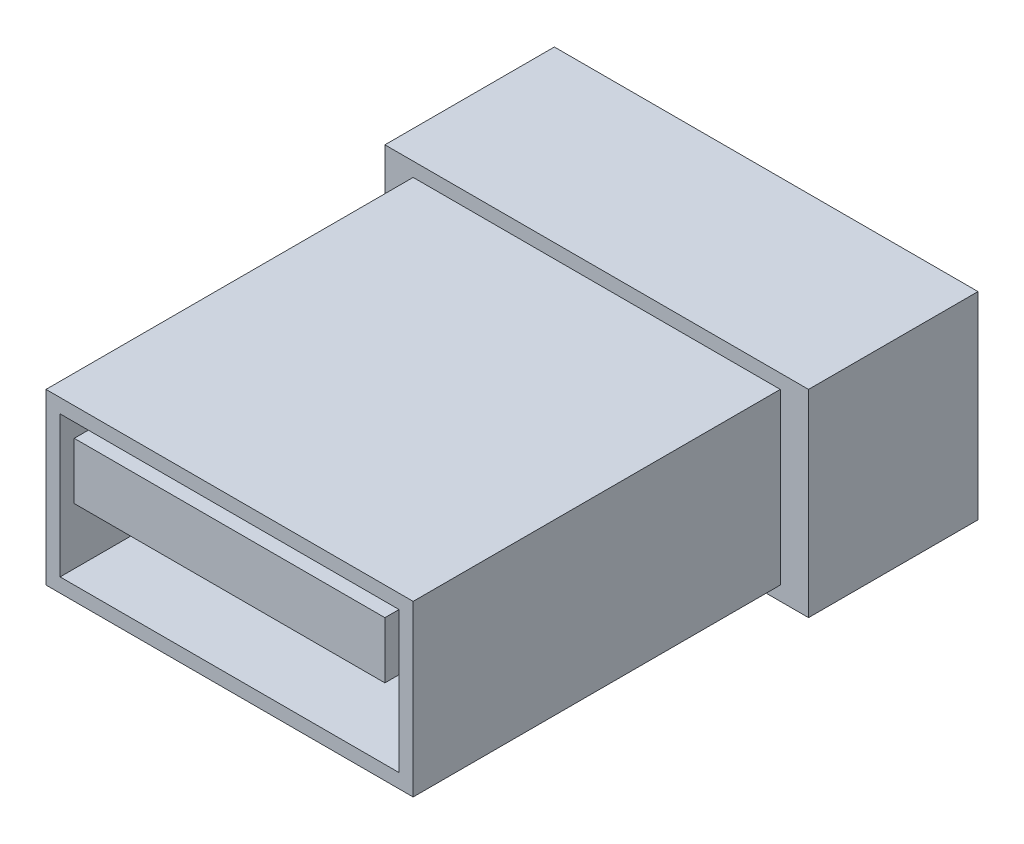
ISO-10303-21;
HEADER;
FILE_DESCRIPTION(('STEP AP214'),'2;1');
FILE_NAME('part.step','',(''),(''),'','','');
FILE_SCHEMA(('AUTOMOTIVE_DESIGN { 1 0 10303 214 1 1 1 1 }'));
ENDSEC;
DATA;
#1=APPLICATION_CONTEXT('core data for automotive mechanical design processes');
#2=APPLICATION_PROTOCOL_DEFINITION('international standard','automotive_design',2000,#1);
#3=PRODUCT_CONTEXT('',#1,'mechanical');
#4=PRODUCT('Part','Part','',(#3));
#5=PRODUCT_RELATED_PRODUCT_CATEGORY('part','',(#4));
#6=PRODUCT_DEFINITION_FORMATION('','',#4);
#7=PRODUCT_DEFINITION_CONTEXT('part definition',#1,'design');
#8=PRODUCT_DEFINITION('design','',#6,#7);
#9=PRODUCT_DEFINITION_SHAPE('','',#8);
#10=(LENGTH_UNIT() NAMED_UNIT(*) SI_UNIT(.MILLI.,.METRE.));
#11=(NAMED_UNIT(*) PLANE_ANGLE_UNIT() SI_UNIT($,.RADIAN.));
#12=(NAMED_UNIT(*) SI_UNIT($,.STERADIAN.) SOLID_ANGLE_UNIT());
#13=UNCERTAINTY_MEASURE_WITH_UNIT(LENGTH_MEASURE(1.E-05),#10,'distance_accuracy_value','');
#14=(GEOMETRIC_REPRESENTATION_CONTEXT(3) GLOBAL_UNCERTAINTY_ASSIGNED_CONTEXT((#13)) GLOBAL_UNIT_ASSIGNED_CONTEXT((#10,
#11,#12)) REPRESENTATION_CONTEXT('',''));
#15=CARTESIAN_POINT('',(0.,0.,0.));
#16=DIRECTION('',(0.,0.,1.));
#17=DIRECTION('',(1.,0.,0.));
#18=AXIS2_PLACEMENT_3D('',#15,#16,#17);
#19=CARTESIAN_POINT('',(6.,6.,0.));
#20=DIRECTION('',(0.,0.,-1.));
#21=DIRECTION('',(0.,1.,0.));
#22=AXIS2_PLACEMENT_3D('',#19,#20,#21);
#23=PLANE('',#22);
#24=DIRECTION('',(-1.,0.,0.));
#25=VECTOR('',#24,1.);
#26=CARTESIAN_POINT('',(6.,-1.,0.));
#27=LINE('',#26,#25);
#28=CARTESIAN_POINT('',(7.5,-1.,0.));
#29=VERTEX_POINT('',#28);
#30=CARTESIAN_POINT('',(-7.5,-1.,0.));
#31=VERTEX_POINT('',#30);
#32=EDGE_CURVE('E333',#29,#31,#27,.T.);
#33=ORIENTED_EDGE('',*,*,#32,.F.);
#34=DIRECTION('',(0.,-1.,0.));
#35=VECTOR('',#34,1.);
#36=CARTESIAN_POINT('',(7.5,6.,0.));
#37=LINE('',#36,#35);
#38=CARTESIAN_POINT('',(7.5,6.,0.));
#39=VERTEX_POINT('',#38);
#40=EDGE_CURVE('E316',#39,#29,#37,.T.);
#41=ORIENTED_EDGE('',*,*,#40,.F.);
#42=DIRECTION('',(-1.,0.,0.));
#43=VECTOR('',#42,1.);
#44=CARTESIAN_POINT('',(6.,6.,0.));
#45=LINE('',#44,#43);
#46=CARTESIAN_POINT('',(-7.5,6.,0.));
#47=VERTEX_POINT('',#46);
#48=EDGE_CURVE('E350',#39,#47,#45,.T.);
#49=ORIENTED_EDGE('',*,*,#48,.T.);
#50=DIRECTION('',(0.,-1.,0.));
#51=VECTOR('',#50,1.);
#52=CARTESIAN_POINT('',(-7.5,6.,0.));
#53=LINE('',#52,#51);
#54=EDGE_CURVE('E303',#47,#31,#53,.T.);
#55=ORIENTED_EDGE('',*,*,#54,.T.);
#56=EDGE_LOOP('',(#33,#41,#49,#55));
#57=FACE_BOUND('',#56,.T.);
#58=DIRECTION('',(0.,-1.,0.));
#59=VECTOR('',#58,1.);
#60=CARTESIAN_POINT('',(-6.5,5.,0.));
#61=LINE('',#60,#59);
#62=CARTESIAN_POINT('',(-6.5,5.5,0.));
#63=VERTEX_POINT('',#62);
#64=CARTESIAN_POINT('',(-6.5,-0.499999999999999,0.));
#65=VERTEX_POINT('',#64);
#66=EDGE_CURVE('E197',#63,#65,#61,.T.);
#67=ORIENTED_EDGE('',*,*,#66,.F.);
#68=DIRECTION('',(-1.,0.,0.));
#69=VECTOR('',#68,1.);
#70=CARTESIAN_POINT('',(-6.,5.5,0.));
#71=LINE('',#70,#69);
#72=CARTESIAN_POINT('',(6.5,5.5,0.));
#73=VERTEX_POINT('',#72);
#74=EDGE_CURVE('E236',#73,#63,#71,.T.);
#75=ORIENTED_EDGE('',*,*,#74,.F.);
#76=DIRECTION('',(0.,1.,0.));
#77=VECTOR('',#76,1.);
#78=CARTESIAN_POINT('',(6.5,5.,0.));
#79=LINE('',#78,#77);
#80=CARTESIAN_POINT('',(6.5,-0.5,0.));
#81=VERTEX_POINT('',#80);
#82=EDGE_CURVE('E86',#81,#73,#79,.T.);
#83=ORIENTED_EDGE('',*,*,#82,.F.);
#84=DIRECTION('',(1.,0.,0.));
#85=VECTOR('',#84,1.);
#86=CARTESIAN_POINT('',(-6.,-0.499999999999999,0.));
#87=LINE('',#86,#85);
#88=EDGE_CURVE('E81',#65,#81,#87,.T.);
#89=ORIENTED_EDGE('',*,*,#88,.F.);
#90=EDGE_LOOP('',(#67,#75,#83,#89));
#91=FACE_BOUND('',#90,.T.);
#92=ADVANCED_FACE('F65',(#57,#91),#23,.F.);
#93=CARTESIAN_POINT('',(6.,6.,-6.));
#94=DIRECTION('',(0.,0.,-1.));
#95=DIRECTION('',(0.,1.,0.));
#96=AXIS2_PLACEMENT_3D('',#93,#94,#95);
#97=PLANE('',#96);
#98=DIRECTION('',(-1.,0.,0.));
#99=VECTOR('',#98,1.);
#100=CARTESIAN_POINT('',(6.,-1.,-6.));
#101=LINE('',#100,#99);
#102=CARTESIAN_POINT('',(7.5,-1.,-6.));
#103=VERTEX_POINT('',#102);
#104=CARTESIAN_POINT('',(-7.5,-1.,-6.));
#105=VERTEX_POINT('',#104);
#106=EDGE_CURVE('E12',#103,#105,#101,.T.);
#107=ORIENTED_EDGE('',*,*,#106,.T.);
#108=DIRECTION('',(0.,1.,0.));
#109=VECTOR('',#108,1.);
#110=CARTESIAN_POINT('',(-7.5,6.,-6.));
#111=LINE('',#110,#109);
#112=CARTESIAN_POINT('',(-7.5,6.,-6.));
#113=VERTEX_POINT('',#112);
#114=EDGE_CURVE('E341',#105,#113,#111,.T.);
#115=ORIENTED_EDGE('',*,*,#114,.T.);
#116=DIRECTION('',(-1.,0.,0.));
#117=VECTOR('',#116,1.);
#118=CARTESIAN_POINT('',(6.,6.,-6.));
#119=LINE('',#118,#117);
#120=CARTESIAN_POINT('',(7.5,6.,-6.));
#121=VERTEX_POINT('',#120);
#122=EDGE_CURVE('E74',#121,#113,#119,.T.);
#123=ORIENTED_EDGE('',*,*,#122,.F.);
#124=DIRECTION('',(0.,1.,0.));
#125=VECTOR('',#124,1.);
#126=CARTESIAN_POINT('',(7.5,6.,-6.));
#127=LINE('',#126,#125);
#128=EDGE_CURVE('E325',#103,#121,#127,.T.);
#129=ORIENTED_EDGE('',*,*,#128,.F.);
#130=EDGE_LOOP('',(#107,#115,#123,#129));
#131=FACE_BOUND('',#130,.T.);
#132=ADVANCED_FACE('F361',(#131),#97,.T.);
#133=CARTESIAN_POINT('',(6.,6.,0.));
#134=DIRECTION('',(0.,1.,0.));
#135=DIRECTION('',(0.,0.,1.));
#136=AXIS2_PLACEMENT_3D('',#133,#134,#135);
#137=PLANE('',#136);
#138=ORIENTED_EDGE('',*,*,#122,.T.);
#139=DIRECTION('',(0.,0.,1.));
#140=VECTOR('',#139,1.);
#141=CARTESIAN_POINT('',(-7.5,6.,0.));
#142=LINE('',#141,#140);
#143=EDGE_CURVE('E321',#113,#47,#142,.T.);
#144=ORIENTED_EDGE('',*,*,#143,.T.);
#145=ORIENTED_EDGE('',*,*,#48,.F.);
#146=DIRECTION('',(0.,0.,1.));
#147=VECTOR('',#146,1.);
#148=CARTESIAN_POINT('',(7.5,6.,0.));
#149=LINE('',#148,#147);
#150=EDGE_CURVE('E329',#121,#39,#149,.T.);
#151=ORIENTED_EDGE('',*,*,#150,.F.);
#152=EDGE_LOOP('',(#138,#144,#145,#151));
#153=FACE_BOUND('',#152,.T.);
#154=ADVANCED_FACE('F355',(#153),#137,.T.);
#155=CARTESIAN_POINT('',(6.,-1.,0.));
#156=DIRECTION('',(0.,1.,0.));
#157=DIRECTION('',(0.,0.,1.));
#158=AXIS2_PLACEMENT_3D('',#155,#156,#157);
#159=PLANE('',#158);
#160=ORIENTED_EDGE('',*,*,#32,.T.);
#161=DIRECTION('',(0.,0.,-1.));
#162=VECTOR('',#161,1.);
#163=CARTESIAN_POINT('',(-7.5,-1.,0.));
#164=LINE('',#163,#162);
#165=EDGE_CURVE('E337',#31,#105,#164,.T.);
#166=ORIENTED_EDGE('',*,*,#165,.T.);
#167=ORIENTED_EDGE('',*,*,#106,.F.);
#168=DIRECTION('',(0.,0.,-1.));
#169=VECTOR('',#168,1.);
#170=CARTESIAN_POINT('',(7.5,-1.,0.));
#171=LINE('',#170,#169);
#172=EDGE_CURVE('E320',#29,#103,#171,.T.);
#173=ORIENTED_EDGE('',*,*,#172,.F.);
#174=EDGE_LOOP('',(#160,#166,#167,#173));
#175=FACE_BOUND('',#174,.T.);
#176=ADVANCED_FACE('F67',(#175),#159,.F.);
#177=CARTESIAN_POINT('',(-7.5,0.,0.));
#178=DIRECTION('',(1.,0.,0.));
#179=DIRECTION('',(0.,0.,-1.));
#180=AXIS2_PLACEMENT_3D('',#177,#178,#179);
#181=PLANE('',#180);
#182=ORIENTED_EDGE('',*,*,#54,.F.);
#183=ORIENTED_EDGE('',*,*,#143,.F.);
#184=ORIENTED_EDGE('',*,*,#114,.F.);
#185=ORIENTED_EDGE('',*,*,#165,.F.);
#186=EDGE_LOOP('',(#182,#183,#184,#185));
#187=FACE_BOUND('',#186,.T.);
#188=ADVANCED_FACE('F364',(#187),#181,.F.);
#189=CARTESIAN_POINT('',(7.5,0.,0.));
#190=DIRECTION('',(1.,0.,0.));
#191=DIRECTION('',(0.,0.,-1.));
#192=AXIS2_PLACEMENT_3D('',#189,#190,#191);
#193=PLANE('',#192);
#194=ORIENTED_EDGE('',*,*,#40,.T.);
#195=ORIENTED_EDGE('',*,*,#172,.T.);
#196=ORIENTED_EDGE('',*,*,#128,.T.);
#197=ORIENTED_EDGE('',*,*,#150,.T.);
#198=EDGE_LOOP('',(#194,#195,#196,#197));
#199=FACE_BOUND('',#198,.T.);
#200=ADVANCED_FACE('F369',(#199),#193,.T.);
#201=CARTESIAN_POINT('',(0.,0.,13.));
#202=DIRECTION('',(0.,0.,1.));
#203=DIRECTION('',(1.,0.,0.));
#204=AXIS2_PLACEMENT_3D('',#201,#202,#203);
#205=PLANE('',#204);
#206=DIRECTION('',(0.,-1.,0.));
#207=VECTOR('',#206,1.);
#208=CARTESIAN_POINT('',(-6.5,5.,13.));
#209=LINE('',#208,#207);
#210=CARTESIAN_POINT('',(-6.5,5.5,13.));
#211=VERTEX_POINT('',#210);
#212=CARTESIAN_POINT('',(-6.5,-0.499999999999999,13.));
#213=VERTEX_POINT('',#212);
#214=EDGE_CURVE('E231',#211,#213,#209,.T.);
#215=ORIENTED_EDGE('',*,*,#214,.T.);
#216=DIRECTION('',(1.,0.,0.));
#217=VECTOR('',#216,1.);
#218=CARTESIAN_POINT('',(-6.,-0.499999999999999,13.));
#219=LINE('',#218,#217);
#220=CARTESIAN_POINT('',(6.5,-0.499999999999999,13.));
#221=VERTEX_POINT('',#220);
#222=EDGE_CURVE('E235',#213,#221,#219,.T.);
#223=ORIENTED_EDGE('',*,*,#222,.T.);
#224=DIRECTION('',(0.,1.,0.));
#225=VECTOR('',#224,1.);
#226=CARTESIAN_POINT('',(6.5,5.,13.));
#227=LINE('',#226,#225);
#228=CARTESIAN_POINT('',(6.5,5.5,13.));
#229=VERTEX_POINT('',#228);
#230=EDGE_CURVE('E239',#221,#229,#227,.T.);
#231=ORIENTED_EDGE('',*,*,#230,.T.);
#232=DIRECTION('',(-1.,0.,0.));
#233=VECTOR('',#232,1.);
#234=CARTESIAN_POINT('',(-6.,5.5,13.));
#235=LINE('',#234,#233);
#236=EDGE_CURVE('E242',#229,#211,#235,.T.);
#237=ORIENTED_EDGE('',*,*,#236,.T.);
#238=EDGE_LOOP('',(#215,#223,#231,#237));
#239=FACE_BOUND('',#238,.T.);
#240=DIRECTION('',(1.,0.,0.));
#241=VECTOR('',#240,1.);
#242=CARTESIAN_POINT('',(-6.,0.,13.));
#243=LINE('',#242,#241);
#244=CARTESIAN_POINT('',(-6.,0.,13.));
#245=VERTEX_POINT('',#244);
#246=CARTESIAN_POINT('',(6.,0.,13.));
#247=VERTEX_POINT('',#246);
#248=EDGE_CURVE('E188',#245,#247,#243,.T.);
#249=ORIENTED_EDGE('',*,*,#248,.F.);
#250=DIRECTION('',(0.,-1.,0.));
#251=VECTOR('',#250,1.);
#252=CARTESIAN_POINT('',(-6.,5.,13.));
#253=LINE('',#252,#251);
#254=CARTESIAN_POINT('',(-6.,5.,13.));
#255=VERTEX_POINT('',#254);
#256=EDGE_CURVE('E177',#255,#245,#253,.T.);
#257=ORIENTED_EDGE('',*,*,#256,.F.);
#258=DIRECTION('',(-1.,0.,0.));
#259=VECTOR('',#258,1.);
#260=CARTESIAN_POINT('',(-6.,5.,13.));
#261=LINE('',#260,#259);
#262=CARTESIAN_POINT('',(6.,5.,13.));
#263=VERTEX_POINT('',#262);
#264=EDGE_CURVE('E207',#263,#255,#261,.T.);
#265=ORIENTED_EDGE('',*,*,#264,.F.);
#266=DIRECTION('',(0.,1.,0.));
#267=VECTOR('',#266,1.);
#268=CARTESIAN_POINT('',(6.,5.,13.));
#269=LINE('',#268,#267);
#270=EDGE_CURVE('E203',#247,#263,#269,.T.);
#271=ORIENTED_EDGE('',*,*,#270,.F.);
#272=EDGE_LOOP('',(#249,#257,#265,#271));
#273=FACE_BOUND('',#272,.T.);
#274=ADVANCED_FACE('F201',(#239,#273),#205,.T.);
#275=CARTESIAN_POINT('',(-6.5,5.,13.));
#276=DIRECTION('',(1.,0.,0.));
#277=DIRECTION('',(0.,1.,0.));
#278=AXIS2_PLACEMENT_3D('',#275,#276,#277);
#279=PLANE('',#278);
#280=ORIENTED_EDGE('',*,*,#66,.T.);
#281=DIRECTION('',(0.,0.,-1.));
#282=VECTOR('',#281,1.);
#283=CARTESIAN_POINT('',(-6.5,-0.499999999999999,13.));
#284=LINE('',#283,#282);
#285=EDGE_CURVE('E267',#213,#65,#284,.T.);
#286=ORIENTED_EDGE('',*,*,#285,.F.);
#287=ORIENTED_EDGE('',*,*,#214,.F.);
#288=DIRECTION('',(0.,0.,-1.));
#289=VECTOR('',#288,1.);
#290=CARTESIAN_POINT('',(-6.5,5.5,13.));
#291=LINE('',#290,#289);
#292=EDGE_CURVE('E245',#211,#63,#291,.T.);
#293=ORIENTED_EDGE('',*,*,#292,.T.);
#294=EDGE_LOOP('',(#280,#286,#287,#293));
#295=FACE_BOUND('',#294,.T.);
#296=ADVANCED_FACE('F424',(#295),#279,.F.);
#297=CARTESIAN_POINT('',(-6.,-0.499999999999999,13.));
#298=DIRECTION('',(0.,1.,0.));
#299=DIRECTION('',(0.,0.,1.));
#300=AXIS2_PLACEMENT_3D('',#297,#298,#299);
#301=PLANE('',#300);
#302=ORIENTED_EDGE('',*,*,#88,.T.);
#303=DIRECTION('',(0.,0.,-1.));
#304=VECTOR('',#303,1.);
#305=CARTESIAN_POINT('',(6.5,-0.499999999999999,13.));
#306=LINE('',#305,#304);
#307=EDGE_CURVE('E263',#221,#81,#306,.T.);
#308=ORIENTED_EDGE('',*,*,#307,.F.);
#309=ORIENTED_EDGE('',*,*,#222,.F.);
#310=ORIENTED_EDGE('',*,*,#285,.T.);
#311=EDGE_LOOP('',(#302,#308,#309,#310));
#312=FACE_BOUND('',#311,.T.);
#313=ADVANCED_FACE('F430',(#312),#301,.F.);
#314=CARTESIAN_POINT('',(6.5,5.,13.));
#315=DIRECTION('',(-1.,0.,0.));
#316=DIRECTION('',(0.,-1.,0.));
#317=AXIS2_PLACEMENT_3D('',#314,#315,#316);
#318=PLANE('',#317);
#319=ORIENTED_EDGE('',*,*,#82,.T.);
#320=DIRECTION('',(0.,0.,-1.));
#321=VECTOR('',#320,1.);
#322=CARTESIAN_POINT('',(6.5,5.5,13.));
#323=LINE('',#322,#321);
#324=EDGE_CURVE('E259',#229,#73,#323,.T.);
#325=ORIENTED_EDGE('',*,*,#324,.F.);
#326=ORIENTED_EDGE('',*,*,#230,.F.);
#327=ORIENTED_EDGE('',*,*,#307,.T.);
#328=EDGE_LOOP('',(#319,#325,#326,#327));
#329=FACE_BOUND('',#328,.T.);
#330=ADVANCED_FACE('F439',(#329),#318,.F.);
#331=CARTESIAN_POINT('',(-6.,5.5,13.));
#332=DIRECTION('',(0.,-1.,0.));
#333=DIRECTION('',(0.,0.,-1.));
#334=AXIS2_PLACEMENT_3D('',#331,#332,#333);
#335=PLANE('',#334);
#336=ORIENTED_EDGE('',*,*,#74,.T.);
#337=ORIENTED_EDGE('',*,*,#292,.F.);
#338=ORIENTED_EDGE('',*,*,#236,.F.);
#339=ORIENTED_EDGE('',*,*,#324,.T.);
#340=EDGE_LOOP('',(#336,#337,#338,#339));
#341=FACE_BOUND('',#340,.T.);
#342=ADVANCED_FACE('F436',(#341),#335,.F.);
#343=CARTESIAN_POINT('',(-6.,5.,13.));
#344=DIRECTION('',(1.,0.,0.));
#345=DIRECTION('',(0.,1.,0.));
#346=AXIS2_PLACEMENT_3D('',#343,#344,#345);
#347=PLANE('',#346);
#348=DIRECTION('',(0.,-1.,0.));
#349=VECTOR('',#348,1.);
#350=CARTESIAN_POINT('',(-6.,5.,0.));
#351=LINE('',#350,#349);
#352=CARTESIAN_POINT('',(-6.,5.,0.));
#353=VERTEX_POINT('',#352);
#354=CARTESIAN_POINT('',(-6.,0.,0.));
#355=VERTEX_POINT('',#354);
#356=EDGE_CURVE('E212',#353,#355,#351,.T.);
#357=ORIENTED_EDGE('',*,*,#356,.F.);
#358=DIRECTION('',(0.,0.,-1.));
#359=VECTOR('',#358,1.);
#360=CARTESIAN_POINT('',(-6.,5.,13.));
#361=LINE('',#360,#359);
#362=EDGE_CURVE('E183',#255,#353,#361,.T.);
#363=ORIENTED_EDGE('',*,*,#362,.F.);
#364=ORIENTED_EDGE('',*,*,#256,.T.);
#365=DIRECTION('',(0.,0.,-1.));
#366=VECTOR('',#365,1.);
#367=CARTESIAN_POINT('',(-6.,0.,13.));
#368=LINE('',#367,#366);
#369=EDGE_CURVE('E181',#245,#355,#368,.T.);
#370=ORIENTED_EDGE('',*,*,#369,.T.);
#371=EDGE_LOOP('',(#357,#363,#364,#370));
#372=FACE_BOUND('',#371,.T.);
#373=ADVANCED_FACE('F180',(#372),#347,.T.);
#374=CARTESIAN_POINT('',(-6.,0.,13.));
#375=DIRECTION('',(0.,1.,0.));
#376=DIRECTION('',(0.,0.,1.));
#377=AXIS2_PLACEMENT_3D('',#374,#375,#376);
#378=PLANE('',#377);
#379=DIRECTION('',(1.,0.,0.));
#380=VECTOR('',#379,1.);
#381=CARTESIAN_POINT('',(-6.,0.,0.));
#382=LINE('',#381,#380);
#383=CARTESIAN_POINT('',(6.,0.,0.));
#384=VERTEX_POINT('',#383);
#385=EDGE_CURVE('E195',#355,#384,#382,.T.);
#386=ORIENTED_EDGE('',*,*,#385,.F.);
#387=ORIENTED_EDGE('',*,*,#369,.F.);
#388=ORIENTED_EDGE('',*,*,#248,.T.);
#389=DIRECTION('',(0.,0.,-1.));
#390=VECTOR('',#389,1.);
#391=CARTESIAN_POINT('',(6.,0.,13.));
#392=LINE('',#391,#390);
#393=EDGE_CURVE('E198',#247,#384,#392,.T.);
#394=ORIENTED_EDGE('',*,*,#393,.T.);
#395=EDGE_LOOP('',(#386,#387,#388,#394));
#396=FACE_BOUND('',#395,.T.);
#397=ADVANCED_FACE('F192',(#396),#378,.T.);
#398=CARTESIAN_POINT('',(6.,5.,13.));
#399=DIRECTION('',(-1.,0.,0.));
#400=DIRECTION('',(0.,-1.,0.));
#401=AXIS2_PLACEMENT_3D('',#398,#399,#400);
#402=PLANE('',#401);
#403=DIRECTION('',(0.,1.,0.));
#404=VECTOR('',#403,1.);
#405=CARTESIAN_POINT('',(6.,5.,0.));
#406=LINE('',#405,#404);
#407=CARTESIAN_POINT('',(6.,5.,0.));
#408=VERTEX_POINT('',#407);
#409=EDGE_CURVE('E217',#384,#408,#406,.T.);
#410=ORIENTED_EDGE('',*,*,#409,.F.);
#411=ORIENTED_EDGE('',*,*,#393,.F.);
#412=ORIENTED_EDGE('',*,*,#270,.T.);
#413=DIRECTION('',(0.,0.,-1.));
#414=VECTOR('',#413,1.);
#415=CARTESIAN_POINT('',(6.,5.,13.));
#416=LINE('',#415,#414);
#417=EDGE_CURVE('E226',#263,#408,#416,.T.);
#418=ORIENTED_EDGE('',*,*,#417,.T.);
#419=EDGE_LOOP('',(#410,#411,#412,#418));
#420=FACE_BOUND('',#419,.T.);
#421=ADVANCED_FACE('F563',(#420),#402,.T.);
#422=CARTESIAN_POINT('',(-6.,5.,13.));
#423=DIRECTION('',(0.,-1.,0.));
#424=DIRECTION('',(0.,0.,-1.));
#425=AXIS2_PLACEMENT_3D('',#422,#423,#424);
#426=PLANE('',#425);
#427=DIRECTION('',(-1.,0.,0.));
#428=VECTOR('',#427,1.);
#429=CARTESIAN_POINT('',(-6.,5.,0.));
#430=LINE('',#429,#428);
#431=EDGE_CURVE('E189',#408,#353,#430,.T.);
#432=ORIENTED_EDGE('',*,*,#431,.F.);
#433=ORIENTED_EDGE('',*,*,#417,.F.);
#434=ORIENTED_EDGE('',*,*,#264,.T.);
#435=ORIENTED_EDGE('',*,*,#362,.T.);
#436=EDGE_LOOP('',(#432,#433,#434,#435));
#437=FACE_BOUND('',#436,.T.);
#438=ADVANCED_FACE('F417',(#437),#426,.T.);
#439=CARTESIAN_POINT('',(6.,0.,13.));
#440=DIRECTION('',(0.,0.,-1.));
#441=DIRECTION('',(-1.,0.,0.));
#442=AXIS2_PLACEMENT_3D('',#439,#440,#441);
#443=PLANE('',#442);
#444=DIRECTION('',(0.,-1.,0.));
#445=VECTOR('',#444,1.);
#446=CARTESIAN_POINT('',(-5.5,4.5,13.));
#447=LINE('',#446,#445);
#448=CARTESIAN_POINT('',(-5.5,4.5,13.));
#449=VERTEX_POINT('',#448);
#450=CARTESIAN_POINT('',(-5.5,2.5,13.));
#451=VERTEX_POINT('',#450);
#452=EDGE_CURVE('E287',#449,#451,#447,.T.);
#453=ORIENTED_EDGE('',*,*,#452,.T.);
#454=DIRECTION('',(1.,0.,0.));
#455=VECTOR('',#454,1.);
#456=CARTESIAN_POINT('',(-5.5,2.5,13.));
#457=LINE('',#456,#455);
#458=CARTESIAN_POINT('',(5.5,2.5,13.));
#459=VERTEX_POINT('',#458);
#460=EDGE_CURVE('E282',#451,#459,#457,.T.);
#461=ORIENTED_EDGE('',*,*,#460,.T.);
#462=DIRECTION('',(0.,1.,0.));
#463=VECTOR('',#462,1.);
#464=CARTESIAN_POINT('',(5.5,4.5,13.));
#465=LINE('',#464,#463);
#466=CARTESIAN_POINT('',(5.5,4.5,13.));
#467=VERTEX_POINT('',#466);
#468=EDGE_CURVE('E277',#459,#467,#465,.T.);
#469=ORIENTED_EDGE('',*,*,#468,.T.);
#470=DIRECTION('',(-1.,0.,0.));
#471=VECTOR('',#470,1.);
#472=CARTESIAN_POINT('',(-5.5,4.5,13.));
#473=LINE('',#472,#471);
#474=EDGE_CURVE('E271',#467,#449,#473,.T.);
#475=ORIENTED_EDGE('',*,*,#474,.T.);
#476=EDGE_LOOP('',(#453,#461,#469,#475));
#477=FACE_BOUND('',#476,.T.);
#478=ADVANCED_FACE('F406',(#477),#443,.F.);
#479=CARTESIAN_POINT('',(-5.5,4.5,-13.));
#480=DIRECTION('',(-1.,0.,0.));
#481=DIRECTION('',(0.,0.,1.));
#482=AXIS2_PLACEMENT_3D('',#479,#480,#481);
#483=PLANE('',#482);
#484=DIRECTION('',(0.,-1.,0.));
#485=VECTOR('',#484,1.);
#486=CARTESIAN_POINT('',(-5.5,4.5,0.));
#487=LINE('',#486,#485);
#488=CARTESIAN_POINT('',(-5.5,4.5,0.));
#489=VERTEX_POINT('',#488);
#490=CARTESIAN_POINT('',(-5.5,2.5,0.));
#491=VERTEX_POINT('',#490);
#492=EDGE_CURVE('E291',#489,#491,#487,.T.);
#493=ORIENTED_EDGE('',*,*,#492,.T.);
#494=DIRECTION('',(0.,0.,1.));
#495=VECTOR('',#494,1.);
#496=CARTESIAN_POINT('',(-5.5,2.5,-13.));
#497=LINE('',#496,#495);
#498=EDGE_CURVE('E281',#491,#451,#497,.T.);
#499=ORIENTED_EDGE('',*,*,#498,.T.);
#500=ORIENTED_EDGE('',*,*,#452,.F.);
#501=DIRECTION('',(0.,0.,1.));
#502=VECTOR('',#501,1.);
#503=CARTESIAN_POINT('',(-5.5,4.5,-13.));
#504=LINE('',#503,#502);
#505=EDGE_CURVE('E270',#489,#449,#504,.T.);
#506=ORIENTED_EDGE('',*,*,#505,.F.);
#507=EDGE_LOOP('',(#493,#499,#500,#506));
#508=FACE_BOUND('',#507,.T.);
#509=ADVANCED_FACE('F409',(#508),#483,.T.);
#510=CARTESIAN_POINT('',(-5.5,2.5,-13.));
#511=DIRECTION('',(0.,-1.,0.));
#512=DIRECTION('',(0.,0.,-1.));
#513=AXIS2_PLACEMENT_3D('',#510,#511,#512);
#514=PLANE('',#513);
#515=DIRECTION('',(1.,0.,0.));
#516=VECTOR('',#515,1.);
#517=CARTESIAN_POINT('',(-5.5,2.5,0.));
#518=LINE('',#517,#516);
#519=CARTESIAN_POINT('',(5.5,2.5,0.));
#520=VERTEX_POINT('',#519);
#521=EDGE_CURVE('E295',#491,#520,#518,.T.);
#522=ORIENTED_EDGE('',*,*,#521,.T.);
#523=DIRECTION('',(0.,0.,1.));
#524=VECTOR('',#523,1.);
#525=CARTESIAN_POINT('',(5.5,2.5,-13.));
#526=LINE('',#525,#524);
#527=EDGE_CURVE('E275',#520,#459,#526,.T.);
#528=ORIENTED_EDGE('',*,*,#527,.T.);
#529=ORIENTED_EDGE('',*,*,#460,.F.);
#530=ORIENTED_EDGE('',*,*,#498,.F.);
#531=EDGE_LOOP('',(#522,#528,#529,#530));
#532=FACE_BOUND('',#531,.T.);
#533=ADVANCED_FACE('F404',(#532),#514,.T.);
#534=CARTESIAN_POINT('',(5.5,4.5,-13.));
#535=DIRECTION('',(1.,0.,0.));
#536=DIRECTION('',(0.,0.,-1.));
#537=AXIS2_PLACEMENT_3D('',#534,#535,#536);
#538=PLANE('',#537);
#539=DIRECTION('',(0.,1.,0.));
#540=VECTOR('',#539,1.);
#541=CARTESIAN_POINT('',(5.5,4.5,0.));
#542=LINE('',#541,#540);
#543=CARTESIAN_POINT('',(5.5,4.5,0.));
#544=VERTEX_POINT('',#543);
#545=EDGE_CURVE('E299',#520,#544,#542,.T.);
#546=ORIENTED_EDGE('',*,*,#545,.T.);
#547=DIRECTION('',(0.,0.,1.));
#548=VECTOR('',#547,1.);
#549=CARTESIAN_POINT('',(5.5,4.5,-13.));
#550=LINE('',#549,#548);
#551=EDGE_CURVE('E276',#544,#467,#550,.T.);
#552=ORIENTED_EDGE('',*,*,#551,.T.);
#553=ORIENTED_EDGE('',*,*,#468,.F.);
#554=ORIENTED_EDGE('',*,*,#527,.F.);
#555=EDGE_LOOP('',(#546,#552,#553,#554));
#556=FACE_BOUND('',#555,.T.);
#557=ADVANCED_FACE('F391',(#556),#538,.T.);
#558=CARTESIAN_POINT('',(-5.5,4.5,-13.));
#559=DIRECTION('',(0.,1.,0.));
#560=DIRECTION('',(0.,0.,1.));
#561=AXIS2_PLACEMENT_3D('',#558,#559,#560);
#562=PLANE('',#561);
#563=DIRECTION('',(-1.,0.,0.));
#564=VECTOR('',#563,1.);
#565=CARTESIAN_POINT('',(-5.5,4.5,0.));
#566=LINE('',#565,#564);
#567=EDGE_CURVE('E286',#544,#489,#566,.T.);
#568=ORIENTED_EDGE('',*,*,#567,.T.);
#569=ORIENTED_EDGE('',*,*,#505,.T.);
#570=ORIENTED_EDGE('',*,*,#474,.F.);
#571=ORIENTED_EDGE('',*,*,#551,.F.);
#572=EDGE_LOOP('',(#568,#569,#570,#571));
#573=FACE_BOUND('',#572,.T.);
#574=ADVANCED_FACE('F386',(#573),#562,.T.);
#575=ORIENTED_EDGE('',*,*,#431,.T.);
#576=ORIENTED_EDGE('',*,*,#356,.T.);
#577=ORIENTED_EDGE('',*,*,#385,.T.);
#578=ORIENTED_EDGE('',*,*,#409,.T.);
#579=EDGE_LOOP('',(#575,#576,#577,#578));
#580=FACE_BOUND('',#579,.T.);
#581=ORIENTED_EDGE('',*,*,#567,.F.);
#582=ORIENTED_EDGE('',*,*,#545,.F.);
#583=ORIENTED_EDGE('',*,*,#521,.F.);
#584=ORIENTED_EDGE('',*,*,#492,.F.);
#585=EDGE_LOOP('',(#581,#582,#583,#584));
#586=FACE_BOUND('',#585,.T.);
#587=ADVANCED_FACE('F381',(#580,#586),#23,.F.);
#588=CLOSED_SHELL('',(#92,#132,#154,#176,#188,#200,#274,#296,#313,#330,#342,#373,#397,#421,#438,
#478,#509,#533,#557,#574,#587));
#589=MANIFOLD_SOLID_BREP('B2',#588);
#590=ADVANCED_BREP_SHAPE_REPRESENTATION('',(#18,#589),#14);
#591=SHAPE_DEFINITION_REPRESENTATION(#9,#590);
ENDSEC;
END-ISO-10303-21;
